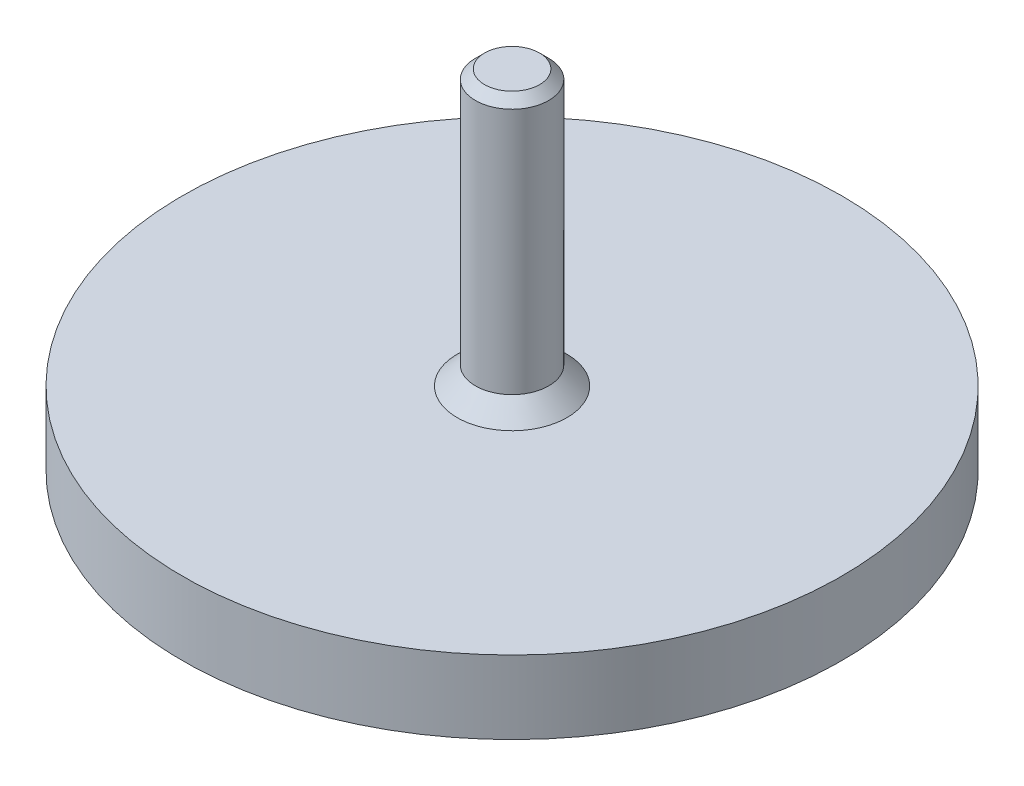
ISO-10303-21;
HEADER;
FILE_DESCRIPTION(('STEP AP214'),'2;1');
FILE_NAME('part.step','',(''),(''),'','','');
FILE_SCHEMA(('AUTOMOTIVE_DESIGN { 1 0 10303 214 1 1 1 1 }'));
ENDSEC;
DATA;
#1=APPLICATION_CONTEXT('core data for automotive mechanical design processes');
#2=APPLICATION_PROTOCOL_DEFINITION('international standard','automotive_design',2000,#1);
#3=PRODUCT_CONTEXT('',#1,'mechanical');
#4=PRODUCT('Part','Part','',(#3));
#5=PRODUCT_RELATED_PRODUCT_CATEGORY('part','',(#4));
#6=PRODUCT_DEFINITION_FORMATION('','',#4);
#7=PRODUCT_DEFINITION_CONTEXT('part definition',#1,'design');
#8=PRODUCT_DEFINITION('design','',#6,#7);
#9=PRODUCT_DEFINITION_SHAPE('','',#8);
#10=(LENGTH_UNIT() NAMED_UNIT(*) SI_UNIT(.MILLI.,.METRE.));
#11=(NAMED_UNIT(*) PLANE_ANGLE_UNIT() SI_UNIT($,.RADIAN.));
#12=(NAMED_UNIT(*) SI_UNIT($,.STERADIAN.) SOLID_ANGLE_UNIT());
#13=UNCERTAINTY_MEASURE_WITH_UNIT(LENGTH_MEASURE(1.E-05),#10,'distance_accuracy_value','');
#14=(GEOMETRIC_REPRESENTATION_CONTEXT(3) GLOBAL_UNCERTAINTY_ASSIGNED_CONTEXT((#13)) GLOBAL_UNIT_ASSIGNED_CONTEXT((#10,
#11,#12)) REPRESENTATION_CONTEXT('',''));
#15=CARTESIAN_POINT('',(0.,0.,0.));
#16=DIRECTION('',(0.,0.,1.));
#17=DIRECTION('',(1.,0.,0.));
#18=AXIS2_PLACEMENT_3D('',#15,#16,#17);
#19=CARTESIAN_POINT('',(0.,0.,0.));
#20=DIRECTION('',(0.,1.,0.));
#21=DIRECTION('',(0.,0.,1.));
#22=AXIS2_PLACEMENT_3D('',#19,#20,#21);
#23=PLANE('',#22);
#24=CARTESIAN_POINT('',(0.,0.,0.));
#25=DIRECTION('',(0.,-1.,0.));
#26=DIRECTION('',(0.,0.,-1.));
#27=AXIS2_PLACEMENT_3D('',#24,#25,#26);
#28=CIRCLE('',#27,18.);
#29=CARTESIAN_POINT('',(0.,0.,-18.));
#30=VERTEX_POINT('',#29);
#31=EDGE_CURVE('E49',#30,#30,#28,.T.);
#32=ORIENTED_EDGE('',*,*,#31,.T.);
#33=EDGE_LOOP('',(#32));
#34=FACE_BOUND('',#33,.T.);
#35=ADVANCED_FACE('F29',(#34),#23,.F.);
#36=CARTESIAN_POINT('',(0.,0.,0.));
#37=DIRECTION('',(0.,-1.,0.));
#38=DIRECTION('',(0.,0.,-1.));
#39=AXIS2_PLACEMENT_3D('',#36,#37,#38);
#40=CYLINDRICAL_SURFACE('',#39,18.);
#41=ORIENTED_EDGE('',*,*,#31,.F.);
#42=EDGE_LOOP('',(#41));
#43=FACE_BOUND('',#42,.T.);
#44=CARTESIAN_POINT('',(0.,4.,0.));
#45=DIRECTION('',(0.,-1.,0.));
#46=DIRECTION('',(0.,0.,-1.));
#47=AXIS2_PLACEMENT_3D('',#44,#45,#46);
#48=CIRCLE('',#47,18.);
#49=CARTESIAN_POINT('',(0.,4.,-18.));
#50=VERTEX_POINT('',#49);
#51=EDGE_CURVE('E52',#50,#50,#48,.T.);
#52=ORIENTED_EDGE('',*,*,#51,.T.);
#53=EDGE_LOOP('',(#52));
#54=FACE_BOUND('',#53,.T.);
#55=ADVANCED_FACE('F56',(#43,#54),#40,.T.);
#56=CARTESIAN_POINT('',(-18.,4.,0.));
#57=DIRECTION('',(0.,-1.,0.));
#58=DIRECTION('',(0.,0.,-1.));
#59=AXIS2_PLACEMENT_3D('',#56,#57,#58);
#60=PLANE('',#59);
#61=CARTESIAN_POINT('',(0.,4.,0.));
#62=DIRECTION('',(0.,-1.,0.));
#63=DIRECTION('',(0.,0.,-1.));
#64=AXIS2_PLACEMENT_3D('',#61,#62,#63);
#65=CIRCLE('',#64,3.);
#66=CARTESIAN_POINT('',(0.,4.,-3.));
#67=VERTEX_POINT('',#66);
#68=EDGE_CURVE('E44',#67,#67,#65,.T.);
#69=ORIENTED_EDGE('',*,*,#68,.T.);
#70=EDGE_LOOP('',(#69));
#71=FACE_BOUND('',#70,.T.);
#72=ORIENTED_EDGE('',*,*,#51,.F.);
#73=EDGE_LOOP('',(#72));
#74=FACE_BOUND('',#73,.T.);
#75=ADVANCED_FACE('F58',(#71,#74),#60,.F.);
#76=CARTESIAN_POINT('',(0.,0.,0.));
#77=DIRECTION('',(0.,-1.,0.));
#78=DIRECTION('',(0.,0.,-1.));
#79=AXIS2_PLACEMENT_3D('',#76,#77,#78);
#80=CYLINDRICAL_SURFACE('',#79,2.);
#81=CARTESIAN_POINT('',(0.,18.5,0.));
#82=DIRECTION('',(0.,-1.,0.));
#83=DIRECTION('',(0.,0.,-1.));
#84=AXIS2_PLACEMENT_3D('',#81,#82,#83);
#85=CIRCLE('',#84,2.);
#86=CARTESIAN_POINT('',(0.,18.5,-2.));
#87=VERTEX_POINT('',#86);
#88=EDGE_CURVE('E36',#87,#87,#85,.T.);
#89=ORIENTED_EDGE('',*,*,#88,.T.);
#90=EDGE_LOOP('',(#89));
#91=FACE_BOUND('',#90,.T.);
#92=CARTESIAN_POINT('',(0.,4.99999999999999,0.));
#93=DIRECTION('',(0.,-1.,0.));
#94=DIRECTION('',(0.,0.,-1.));
#95=AXIS2_PLACEMENT_3D('',#92,#93,#94);
#96=CIRCLE('',#95,2.);
#97=CARTESIAN_POINT('',(0.,4.99999999999999,-2.));
#98=VERTEX_POINT('',#97);
#99=EDGE_CURVE('E40',#98,#98,#96,.F.);
#100=ORIENTED_EDGE('',*,*,#99,.T.);
#101=EDGE_LOOP('',(#100));
#102=FACE_BOUND('',#101,.T.);
#103=ADVANCED_FACE('F60',(#91,#102),#80,.T.);
#104=CARTESIAN_POINT('',(-2.,19.,0.));
#105=DIRECTION('',(0.,-1.,0.));
#106=DIRECTION('',(0.,0.,-1.));
#107=AXIS2_PLACEMENT_3D('',#104,#105,#106);
#108=PLANE('',#107);
#109=CARTESIAN_POINT('',(0.,19.,0.));
#110=DIRECTION('',(0.,-1.,0.));
#111=DIRECTION('',(0.,0.,-1.));
#112=AXIS2_PLACEMENT_3D('',#109,#110,#111);
#113=CIRCLE('',#112,1.5);
#114=CARTESIAN_POINT('',(0.,19.,-1.5));
#115=VERTEX_POINT('',#114);
#116=EDGE_CURVE('E10',#115,#115,#113,.F.);
#117=ORIENTED_EDGE('',*,*,#116,.T.);
#118=EDGE_LOOP('',(#117));
#119=FACE_BOUND('',#118,.T.);
#120=ADVANCED_FACE('F67',(#119),#108,.F.);
#121=CARTESIAN_POINT('',(0.,4.,0.));
#122=DIRECTION('',(0.,-1.,0.));
#123=DIRECTION('',(0.,0.,-1.));
#124=AXIS2_PLACEMENT_3D('',#121,#122,#123);
#125=CONICAL_SURFACE('',#124,3.,0.785398163397455);
#126=ORIENTED_EDGE('',*,*,#99,.F.);
#127=EDGE_LOOP('',(#126));
#128=FACE_BOUND('',#127,.T.);
#129=ORIENTED_EDGE('',*,*,#68,.F.);
#130=EDGE_LOOP('',(#129));
#131=FACE_BOUND('',#130,.T.);
#132=ADVANCED_FACE('F76',(#128,#131),#125,.T.);
#133=CARTESIAN_POINT('',(0.,18.5,0.));
#134=DIRECTION('',(0.,-1.,0.));
#135=DIRECTION('',(0.,0.,-1.));
#136=AXIS2_PLACEMENT_3D('',#133,#134,#135);
#137=CONICAL_SURFACE('',#136,2.,0.785398163397454);
#138=ORIENTED_EDGE('',*,*,#116,.F.);
#139=EDGE_LOOP('',(#138));
#140=FACE_BOUND('',#139,.T.);
#141=ORIENTED_EDGE('',*,*,#88,.F.);
#142=EDGE_LOOP('',(#141));
#143=FACE_BOUND('',#142,.T.);
#144=ADVANCED_FACE('F31',(#140,#143),#137,.T.);
#145=CLOSED_SHELL('',(#35,#55,#75,#103,#120,#132,#144));
#146=MANIFOLD_SOLID_BREP('B2',#145);
#147=ADVANCED_BREP_SHAPE_REPRESENTATION('',(#18,#146),#14);
#148=SHAPE_DEFINITION_REPRESENTATION(#9,#147);
ENDSEC;
END-ISO-10303-21;
